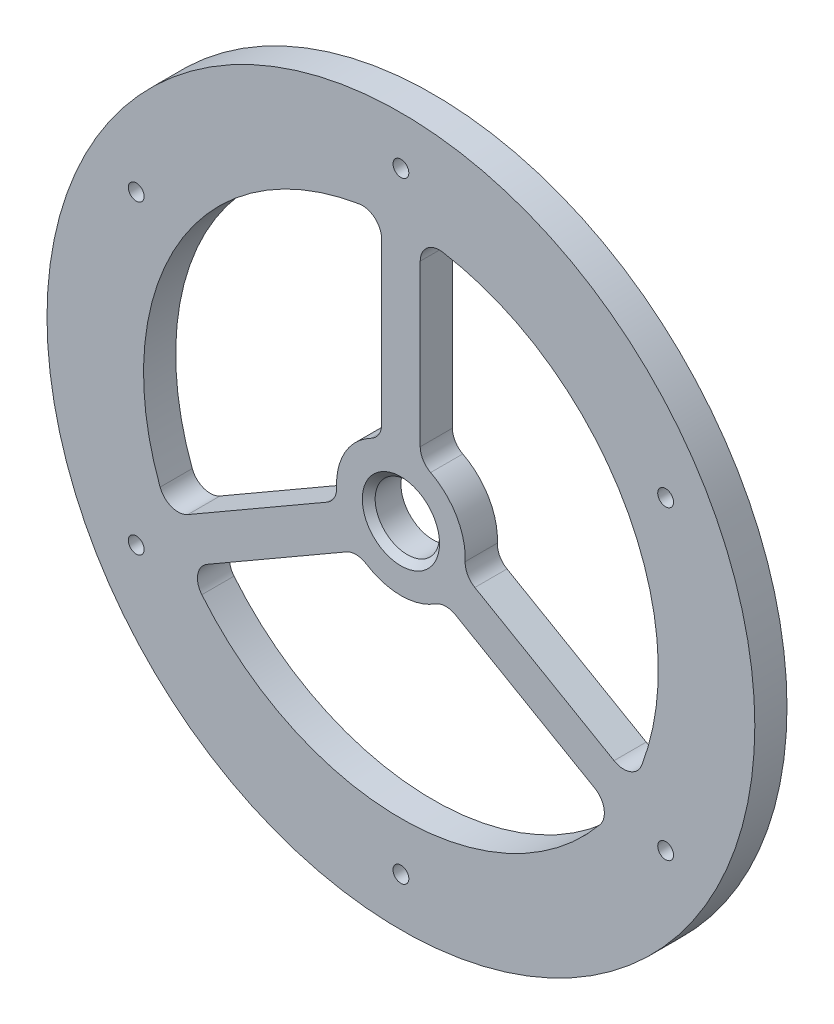
ISO-10303-21;
HEADER;
FILE_DESCRIPTION(('STEP AP214'),'2;1');
FILE_NAME('part.step','',(''),(''),'','','');
FILE_SCHEMA(('AUTOMOTIVE_DESIGN { 1 0 10303 214 1 1 1 1 }'));
ENDSEC;
DATA;
#1=APPLICATION_CONTEXT('core data for automotive mechanical design processes');
#2=APPLICATION_PROTOCOL_DEFINITION('international standard','automotive_design',2000,#1);
#3=PRODUCT_CONTEXT('',#1,'mechanical');
#4=PRODUCT('Part','Part','',(#3));
#5=PRODUCT_RELATED_PRODUCT_CATEGORY('part','',(#4));
#6=PRODUCT_DEFINITION_FORMATION('','',#4);
#7=PRODUCT_DEFINITION_CONTEXT('part definition',#1,'design');
#8=PRODUCT_DEFINITION('design','',#6,#7);
#9=PRODUCT_DEFINITION_SHAPE('','',#8);
#10=(LENGTH_UNIT() NAMED_UNIT(*) SI_UNIT(.MILLI.,.METRE.));
#11=(NAMED_UNIT(*) PLANE_ANGLE_UNIT() SI_UNIT($,.RADIAN.));
#12=(NAMED_UNIT(*) SI_UNIT($,.STERADIAN.) SOLID_ANGLE_UNIT());
#13=UNCERTAINTY_MEASURE_WITH_UNIT(LENGTH_MEASURE(1.E-05),#10,'distance_accuracy_value','');
#14=(GEOMETRIC_REPRESENTATION_CONTEXT(3) GLOBAL_UNCERTAINTY_ASSIGNED_CONTEXT((#13)) GLOBAL_UNIT_ASSIGNED_CONTEXT((#10,
#11,#12)) REPRESENTATION_CONTEXT('',''));
#15=CARTESIAN_POINT('',(0.,0.,0.));
#16=DIRECTION('',(0.,0.,1.));
#17=DIRECTION('',(1.,0.,0.));
#18=AXIS2_PLACEMENT_3D('',#15,#16,#17);
#19=CARTESIAN_POINT('',(-3.,0.,5.));
#20=DIRECTION('',(-1.,0.,0.));
#21=DIRECTION('',(0.,0.,1.));
#22=AXIS2_PLACEMENT_3D('',#19,#20,#21);
#23=PLANE('',#22);
#24=DIRECTION('',(0.,1.,0.));
#25=VECTOR('',#24,1.);
#26=CARTESIAN_POINT('',(-3.,0.,0.));
#27=LINE('',#26,#25);
#28=CARTESIAN_POINT('',(-3.,11.5325625946708,0.));
#29=VERTEX_POINT('',#28);
#30=CARTESIAN_POINT('',(-3.,36.5102725270574,0.));
#31=VERTEX_POINT('',#30);
#32=EDGE_CURVE('E227',#29,#31,#27,.T.);
#33=ORIENTED_EDGE('',*,*,#32,.F.);
#34=DIRECTION('',(0.,0.,-1.));
#35=VECTOR('',#34,1.);
#36=CARTESIAN_POINT('',(-3.,11.5325625946708,5.));
#37=LINE('',#36,#35);
#38=CARTESIAN_POINT('',(-3.,11.5325625946708,5.));
#39=VERTEX_POINT('',#38);
#40=EDGE_CURVE('E204',#29,#39,#37,.F.);
#41=ORIENTED_EDGE('',*,*,#40,.T.);
#42=DIRECTION('',(0.,1.,0.));
#43=VECTOR('',#42,1.);
#44=CARTESIAN_POINT('',(-3.,0.,5.));
#45=LINE('',#44,#43);
#46=CARTESIAN_POINT('',(-3.,36.5102725270574,5.));
#47=VERTEX_POINT('',#46);
#48=EDGE_CURVE('E500',#39,#47,#45,.T.);
#49=ORIENTED_EDGE('',*,*,#48,.T.);
#50=DIRECTION('',(0.,0.,1.));
#51=VECTOR('',#50,1.);
#52=CARTESIAN_POINT('',(-3.,36.5102725270574,0.));
#53=LINE('',#52,#51);
#54=EDGE_CURVE('E220',#47,#31,#53,.F.);
#55=ORIENTED_EDGE('',*,*,#54,.T.);
#56=EDGE_LOOP('',(#33,#41,#49,#55));
#57=FACE_BOUND('',#56,.T.);
#58=ADVANCED_FACE('F36',(#57),#23,.T.);
#59=CARTESIAN_POINT('',(0.,0.,5.));
#60=DIRECTION('',(0.,0.,-1.));
#61=DIRECTION('',(-1.,0.,0.));
#62=AXIS2_PLACEMENT_3D('',#59,#60,#61);
#63=CYLINDRICAL_SURFACE('',#62,10.);
#64=CARTESIAN_POINT('',(0.,0.,5.));
#65=DIRECTION('',(0.,0.,1.));
#66=DIRECTION('',(1.,0.,0.));
#67=AXIS2_PLACEMENT_3D('',#64,#65,#66);
#68=CIRCLE('',#67,10.);
#69=CARTESIAN_POINT('',(-4.61538461538461,8.87120199590061,5.));
#70=VERTEX_POINT('',#69);
#71=CARTESIAN_POINT('',(-9.99037859824546,-0.438560672791265,5.));
#72=VERTEX_POINT('',#71);
#73=EDGE_CURVE('E219',#70,#72,#68,.T.);
#74=ORIENTED_EDGE('',*,*,#73,.F.);
#75=DIRECTION('',(0.,0.,-1.));
#76=VECTOR('',#75,1.);
#77=CARTESIAN_POINT('',(-4.61538461538461,8.87120199590061,5.));
#78=LINE('',#77,#76);
#79=CARTESIAN_POINT('',(-4.61538461538461,8.87120199590061,0.));
#80=VERTEX_POINT('',#79);
#81=EDGE_CURVE('E203',#70,#80,#78,.T.);
#82=ORIENTED_EDGE('',*,*,#81,.T.);
#83=CARTESIAN_POINT('',(0.,0.,0.));
#84=DIRECTION('',(0.,0.,1.));
#85=DIRECTION('',(1.,0.,0.));
#86=AXIS2_PLACEMENT_3D('',#83,#84,#85);
#87=CIRCLE('',#86,10.);
#88=CARTESIAN_POINT('',(-9.99037859824546,-0.438560672791265,0.));
#89=VERTEX_POINT('',#88);
#90=EDGE_CURVE('E216',#80,#89,#87,.T.);
#91=ORIENTED_EDGE('',*,*,#90,.T.);
#92=DIRECTION('',(0.,0.,-1.));
#93=VECTOR('',#92,1.);
#94=CARTESIAN_POINT('',(-9.99037859824546,-0.438560672791265,5.));
#95=LINE('',#94,#93);
#96=EDGE_CURVE('E221',#89,#72,#95,.F.);
#97=ORIENTED_EDGE('',*,*,#96,.T.);
#98=EDGE_LOOP('',(#74,#82,#91,#97));
#99=FACE_BOUND('',#98,.T.);
#100=ADVANCED_FACE('F215',(#99),#63,.T.);
#101=CARTESIAN_POINT('',(-1.49999999999998,2.59807621135333,5.));
#102=DIRECTION('',(0.499999999999992,-0.866025403784443,0.));
#103=DIRECTION('',(0.866025403784443,0.499999999999992,0.));
#104=AXIS2_PLACEMENT_3D('',#101,#102,#103);
#105=PLANE('',#104);
#106=DIRECTION('',(-0.866025403784443,-0.499999999999992,0.));
#107=VECTOR('',#106,1.);
#108=CARTESIAN_POINT('',(-1.49999999999998,2.59807621135333,5.));
#109=LINE('',#108,#107);
#110=CARTESIAN_POINT('',(-11.4874921777191,-3.16820508598198,5.));
#111=VERTEX_POINT('',#110);
#112=CARTESIAN_POINT('',(-33.1188235075249,-15.6570600521751,5.));
#113=VERTEX_POINT('',#112);
#114=EDGE_CURVE('E504',#111,#113,#109,.T.);
#115=ORIENTED_EDGE('',*,*,#114,.F.);
#116=DIRECTION('',(0.,0.,1.));
#117=VECTOR('',#116,1.);
#118=CARTESIAN_POINT('',(-11.4874921777191,-3.16820508598197,0.));
#119=LINE('',#118,#117);
#120=CARTESIAN_POINT('',(-11.4874921777191,-3.16820508598198,0.));
#121=VERTEX_POINT('',#120);
#122=EDGE_CURVE('E246',#111,#121,#119,.F.);
#123=ORIENTED_EDGE('',*,*,#122,.T.);
#124=DIRECTION('',(-0.866025403784443,-0.499999999999992,0.));
#125=VECTOR('',#124,1.);
#126=CARTESIAN_POINT('',(-1.49999999999998,2.59807621135333,0.));
#127=LINE('',#126,#125);
#128=CARTESIAN_POINT('',(-33.1188235075249,-15.6570600521751,0.));
#129=VERTEX_POINT('',#128);
#130=EDGE_CURVE('E226',#121,#129,#127,.T.);
#131=ORIENTED_EDGE('',*,*,#130,.T.);
#132=DIRECTION('',(0.,0.,-1.));
#133=VECTOR('',#132,1.);
#134=CARTESIAN_POINT('',(-33.1188235075249,-15.6570600521751,5.));
#135=LINE('',#134,#133);
#136=EDGE_CURVE('E244',#129,#113,#135,.F.);
#137=ORIENTED_EDGE('',*,*,#136,.T.);
#138=EDGE_LOOP('',(#115,#123,#131,#137));
#139=FACE_BOUND('',#138,.T.);
#140=ADVANCED_FACE('F355',(#139),#105,.F.);
#141=CARTESIAN_POINT('',(0.,0.,5.));
#142=DIRECTION('',(0.,0.,-1.));
#143=DIRECTION('',(-1.,0.,0.));
#144=AXIS2_PLACEMENT_3D('',#141,#142,#143);
#145=CYLINDRICAL_SURFACE('',#144,40.);
#146=CARTESIAN_POINT('',(0.,0.,0.));
#147=DIRECTION('',(0.,0.,1.));
#148=DIRECTION('',(1.,0.,0.));
#149=AXIS2_PLACEMENT_3D('',#146,#147,#148);
#150=CIRCLE('',#149,40.);
#151=CARTESIAN_POINT('',(-30.9392686567838,-25.3527445256595,0.));
#152=VERTEX_POINT('',#151);
#153=CARTESIAN_POINT('',(30.9392686567834,-25.35274452566,0.));
#154=VERTEX_POINT('',#153);
#155=EDGE_CURVE('E538',#152,#154,#150,.T.);
#156=ORIENTED_EDGE('',*,*,#155,.F.);
#157=DIRECTION('',(0.,0.,-1.));
#158=VECTOR('',#157,1.);
#159=CARTESIAN_POINT('',(-30.9392686567838,-25.3527445256595,5.));
#160=LINE('',#159,#158);
#161=CARTESIAN_POINT('',(-30.9392686567838,-25.3527445256595,5.));
#162=VERTEX_POINT('',#161);
#163=EDGE_CURVE('E282',#152,#162,#160,.F.);
#164=ORIENTED_EDGE('',*,*,#163,.T.);
#165=CARTESIAN_POINT('',(0.,0.,5.));
#166=DIRECTION('',(0.,0.,1.));
#167=DIRECTION('',(1.,0.,0.));
#168=AXIS2_PLACEMENT_3D('',#165,#166,#167);
#169=CIRCLE('',#168,40.);
#170=CARTESIAN_POINT('',(30.9392686567834,-25.35274452566,5.));
#171=VERTEX_POINT('',#170);
#172=EDGE_CURVE('E485',#162,#171,#169,.T.);
#173=ORIENTED_EDGE('',*,*,#172,.T.);
#174=DIRECTION('',(0.,0.,-1.));
#175=VECTOR('',#174,1.);
#176=CARTESIAN_POINT('',(30.9392686567834,-25.35274452566,5.));
#177=LINE('',#176,#175);
#178=EDGE_CURVE('E279',#171,#154,#177,.T.);
#179=ORIENTED_EDGE('',*,*,#178,.T.);
#180=EDGE_LOOP('',(#156,#164,#173,#179));
#181=FACE_BOUND('',#180,.T.);
#182=ADVANCED_FACE('F379',(#181),#145,.F.);
#183=CARTESIAN_POINT('',(1.49999999999998,-2.59807621135333,5.));
#184=DIRECTION('',(0.499999999999992,-0.866025403784443,0.));
#185=DIRECTION('',(0.866025403784443,0.499999999999992,0.));
#186=AXIS2_PLACEMENT_3D('',#183,#184,#185);
#187=PLANE('',#186);
#188=DIRECTION('',(-0.866025403784443,-0.499999999999992,0.));
#189=VECTOR('',#188,1.);
#190=CARTESIAN_POINT('',(1.49999999999998,-2.59807621135333,0.));
#191=LINE('',#190,#189);
#192=CARTESIAN_POINT('',(-8.48749217771917,-8.36435750868863,0.));
#193=VERTEX_POINT('',#192);
#194=CARTESIAN_POINT('',(-30.1188235075249,-20.8532124748817,0.));
#195=VERTEX_POINT('',#194);
#196=EDGE_CURVE('E541',#193,#195,#191,.T.);
#197=ORIENTED_EDGE('',*,*,#196,.F.);
#198=DIRECTION('',(0.,0.,-1.));
#199=VECTOR('',#198,1.);
#200=CARTESIAN_POINT('',(-8.48749217771917,-8.36435750868863,5.));
#201=LINE('',#200,#199);
#202=CARTESIAN_POINT('',(-8.48749217771917,-8.36435750868863,5.));
#203=VERTEX_POINT('',#202);
#204=EDGE_CURVE('E277',#193,#203,#201,.F.);
#205=ORIENTED_EDGE('',*,*,#204,.T.);
#206=DIRECTION('',(-0.866025403784443,-0.499999999999992,0.));
#207=VECTOR('',#206,1.);
#208=CARTESIAN_POINT('',(1.49999999999998,-2.59807621135333,5.));
#209=LINE('',#208,#207);
#210=CARTESIAN_POINT('',(-30.1188235075249,-20.8532124748817,5.));
#211=VERTEX_POINT('',#210);
#212=EDGE_CURVE('E488',#203,#211,#209,.T.);
#213=ORIENTED_EDGE('',*,*,#212,.T.);
#214=DIRECTION('',(0.,0.,1.));
#215=VECTOR('',#214,1.);
#216=CARTESIAN_POINT('',(-30.118823507525,-20.8532124748817,0.));
#217=LINE('',#216,#215);
#218=EDGE_CURVE('E274',#211,#195,#217,.F.);
#219=ORIENTED_EDGE('',*,*,#218,.T.);
#220=EDGE_LOOP('',(#197,#205,#213,#219));
#221=FACE_BOUND('',#220,.T.);
#222=ADVANCED_FACE('F375',(#221),#187,.T.);
#223=CARTESIAN_POINT('',(0.,0.,5.));
#224=DIRECTION('',(0.,0.,-1.));
#225=DIRECTION('',(-1.,0.,0.));
#226=AXIS2_PLACEMENT_3D('',#223,#224,#225);
#227=CYLINDRICAL_SURFACE('',#226,10.);
#228=CARTESIAN_POINT('',(0.,0.,0.));
#229=DIRECTION('',(0.,0.,1.));
#230=DIRECTION('',(1.,0.,0.));
#231=AXIS2_PLACEMENT_3D('',#228,#229,#230);
#232=CIRCLE('',#231,10.);
#233=CARTESIAN_POINT('',(-5.37499398286092,-8.4326413231092,0.));
#234=VERTEX_POINT('',#233);
#235=CARTESIAN_POINT('',(5.3749939828608,-8.43264132310928,0.));
#236=VERTEX_POINT('',#235);
#237=EDGE_CURVE('E544',#234,#236,#232,.T.);
#238=ORIENTED_EDGE('',*,*,#237,.T.);
#239=DIRECTION('',(0.,0.,-1.));
#240=VECTOR('',#239,1.);
#241=CARTESIAN_POINT('',(5.37499398286079,-8.43264132310928,5.));
#242=LINE('',#241,#240);
#243=CARTESIAN_POINT('',(5.3749939828608,-8.43264132310928,5.));
#244=VERTEX_POINT('',#243);
#245=EDGE_CURVE('E272',#236,#244,#242,.F.);
#246=ORIENTED_EDGE('',*,*,#245,.T.);
#247=CARTESIAN_POINT('',(0.,0.,5.));
#248=DIRECTION('',(0.,0.,1.));
#249=DIRECTION('',(1.,0.,0.));
#250=AXIS2_PLACEMENT_3D('',#247,#248,#249);
#251=CIRCLE('',#250,10.);
#252=CARTESIAN_POINT('',(-5.37499398286092,-8.4326413231092,5.));
#253=VERTEX_POINT('',#252);
#254=EDGE_CURVE('E491',#253,#244,#251,.T.);
#255=ORIENTED_EDGE('',*,*,#254,.F.);
#256=DIRECTION('',(0.,0.,-1.));
#257=VECTOR('',#256,1.);
#258=CARTESIAN_POINT('',(-5.37499398286092,-8.4326413231092,5.));
#259=LINE('',#258,#257);
#260=EDGE_CURVE('E269',#253,#234,#259,.T.);
#261=ORIENTED_EDGE('',*,*,#260,.T.);
#262=EDGE_LOOP('',(#238,#246,#255,#261));
#263=FACE_BOUND('',#262,.T.);
#264=ADVANCED_FACE('F371',(#263),#227,.T.);
#265=CARTESIAN_POINT('',(0.,0.,5.));
#266=DIRECTION('',(0.,0.,-1.));
#267=DIRECTION('',(-1.,0.,0.));
#268=AXIS2_PLACEMENT_3D('',#265,#266,#267);
#269=CYLINDRICAL_SURFACE('',#268,40.);
#270=CARTESIAN_POINT('',(0.,0.,5.));
#271=DIRECTION('',(0.,0.,1.));
#272=DIRECTION('',(1.,0.,0.));
#273=AXIS2_PLACEMENT_3D('',#270,#271,#272);
#274=CIRCLE('',#273,40.);
#275=CARTESIAN_POINT('',(37.42575514327,-14.1178203684564,5.));
#276=VERTEX_POINT('',#275);
#277=CARTESIAN_POINT('',(6.48648648648649,39.4705648941161,5.));
#278=VERTEX_POINT('',#277);
#279=EDGE_CURVE('E471',#276,#278,#274,.T.);
#280=ORIENTED_EDGE('',*,*,#279,.T.);
#281=DIRECTION('',(0.,0.,-1.));
#282=VECTOR('',#281,1.);
#283=CARTESIAN_POINT('',(6.48648648648649,39.4705648941161,5.));
#284=LINE('',#283,#282);
#285=CARTESIAN_POINT('',(6.48648648648649,39.4705648941161,0.));
#286=VERTEX_POINT('',#285);
#287=EDGE_CURVE('E210',#278,#286,#284,.T.);
#288=ORIENTED_EDGE('',*,*,#287,.T.);
#289=CARTESIAN_POINT('',(0.,0.,0.));
#290=DIRECTION('',(0.,0.,1.));
#291=DIRECTION('',(1.,0.,0.));
#292=AXIS2_PLACEMENT_3D('',#289,#290,#291);
#293=CIRCLE('',#292,40.);
#294=CARTESIAN_POINT('',(37.42575514327,-14.1178203684564,0.));
#295=VERTEX_POINT('',#294);
#296=EDGE_CURVE('E527',#295,#286,#293,.T.);
#297=ORIENTED_EDGE('',*,*,#296,.F.);
#298=DIRECTION('',(0.,0.,-1.));
#299=VECTOR('',#298,1.);
#300=CARTESIAN_POINT('',(37.42575514327,-14.1178203684564,5.));
#301=LINE('',#300,#299);
#302=EDGE_CURVE('E58',#295,#276,#301,.F.);
#303=ORIENTED_EDGE('',*,*,#302,.T.);
#304=EDGE_LOOP('',(#280,#288,#297,#303));
#305=FACE_BOUND('',#304,.T.);
#306=ADVANCED_FACE('F374',(#305),#269,.F.);
#307=CARTESIAN_POINT('',(1.50000000000004,2.59807621135336,5.));
#308=DIRECTION('',(0.500000000000005,0.866025403784436,0.));
#309=DIRECTION('',(-0.866025403784436,0.500000000000005,0.));
#310=AXIS2_PLACEMENT_3D('',#307,#308,#309);
#311=PLANE('',#310);
#312=DIRECTION('',(0.866025403784436,-0.500000000000005,0.));
#313=VECTOR('',#312,1.);
#314=CARTESIAN_POINT('',(1.50000000000004,2.59807621135336,0.));
#315=LINE('',#314,#313);
#316=CARTESIAN_POINT('',(11.4874921777191,-3.16820508598209,0.));
#317=VERTEX_POINT('',#316);
#318=CARTESIAN_POINT('',(33.1188235075247,-15.6570600521755,0.));
#319=VERTEX_POINT('',#318);
#320=EDGE_CURVE('E530',#317,#319,#315,.T.);
#321=ORIENTED_EDGE('',*,*,#320,.F.);
#322=DIRECTION('',(0.,0.,-1.));
#323=VECTOR('',#322,1.);
#324=CARTESIAN_POINT('',(11.4874921777191,-3.16820508598209,5.));
#325=LINE('',#324,#323);
#326=CARTESIAN_POINT('',(11.4874921777191,-3.16820508598209,5.));
#327=VERTEX_POINT('',#326);
#328=EDGE_CURVE('E262',#317,#327,#325,.F.);
#329=ORIENTED_EDGE('',*,*,#328,.T.);
#330=DIRECTION('',(0.866025403784436,-0.500000000000005,0.));
#331=VECTOR('',#330,1.);
#332=CARTESIAN_POINT('',(1.50000000000004,2.59807621135336,5.));
#333=LINE('',#332,#331);
#334=CARTESIAN_POINT('',(33.1188235075247,-15.6570600521755,5.));
#335=VERTEX_POINT('',#334);
#336=EDGE_CURVE('E469',#327,#335,#333,.T.);
#337=ORIENTED_EDGE('',*,*,#336,.T.);
#338=DIRECTION('',(0.,0.,1.));
#339=VECTOR('',#338,1.);
#340=CARTESIAN_POINT('',(33.1188235075247,-15.6570600521755,0.));
#341=LINE('',#340,#339);
#342=EDGE_CURVE('E259',#335,#319,#341,.F.);
#343=ORIENTED_EDGE('',*,*,#342,.T.);
#344=EDGE_LOOP('',(#321,#329,#337,#343));
#345=FACE_BOUND('',#344,.T.);
#346=ADVANCED_FACE('F390',(#345),#311,.T.);
#347=CARTESIAN_POINT('',(0.,0.,5.));
#348=DIRECTION('',(0.,0.,-1.));
#349=DIRECTION('',(-1.,0.,0.));
#350=AXIS2_PLACEMENT_3D('',#347,#348,#349);
#351=CYLINDRICAL_SURFACE('',#350,10.);
#352=CARTESIAN_POINT('',(0.,0.,0.));
#353=DIRECTION('',(0.,0.,1.));
#354=DIRECTION('',(1.,0.,0.));
#355=AXIS2_PLACEMENT_3D('',#352,#353,#354);
#356=CIRCLE('',#355,10.);
#357=CARTESIAN_POINT('',(9.99037859824545,-0.438560672791368,0.));
#358=VERTEX_POINT('',#357);
#359=CARTESIAN_POINT('',(4.61538461538461,8.87120199590061,0.));
#360=VERTEX_POINT('',#359);
#361=EDGE_CURVE('E532',#358,#360,#356,.T.);
#362=ORIENTED_EDGE('',*,*,#361,.T.);
#363=DIRECTION('',(0.,0.,-1.));
#364=VECTOR('',#363,1.);
#365=CARTESIAN_POINT('',(4.61538461538461,8.87120199590061,5.));
#366=LINE('',#365,#364);
#367=CARTESIAN_POINT('',(4.61538461538461,8.87120199590061,5.));
#368=VERTEX_POINT('',#367);
#369=EDGE_CURVE('E257',#360,#368,#366,.F.);
#370=ORIENTED_EDGE('',*,*,#369,.T.);
#371=CARTESIAN_POINT('',(0.,0.,5.));
#372=DIRECTION('',(0.,0.,1.));
#373=DIRECTION('',(1.,0.,0.));
#374=AXIS2_PLACEMENT_3D('',#371,#372,#373);
#375=CIRCLE('',#374,10.);
#376=CARTESIAN_POINT('',(9.99037859824545,-0.438560672791368,5.));
#377=VERTEX_POINT('',#376);
#378=EDGE_CURVE('E475',#377,#368,#375,.T.);
#379=ORIENTED_EDGE('',*,*,#378,.F.);
#380=DIRECTION('',(0.,0.,-1.));
#381=VECTOR('',#380,1.);
#382=CARTESIAN_POINT('',(9.99037859824545,-0.438560672791368,5.));
#383=LINE('',#382,#381);
#384=EDGE_CURVE('E254',#377,#358,#383,.T.);
#385=ORIENTED_EDGE('',*,*,#384,.T.);
#386=EDGE_LOOP('',(#362,#370,#379,#385));
#387=FACE_BOUND('',#386,.T.);
#388=ADVANCED_FACE('F362',(#387),#351,.T.);
#389=CARTESIAN_POINT('',(0.,0.,5.));
#390=DIRECTION('',(0.,0.,-1.));
#391=DIRECTION('',(-1.,0.,0.));
#392=AXIS2_PLACEMENT_3D('',#389,#390,#391);
#393=CYLINDRICAL_SURFACE('',#392,55.);
#394=CARTESIAN_POINT('',(0.,0.,5.));
#395=DIRECTION('',(0.,0.,1.));
#396=DIRECTION('',(1.,0.,0.));
#397=AXIS2_PLACEMENT_3D('',#394,#395,#396);
#398=CIRCLE('',#397,55.);
#399=CARTESIAN_POINT('',(55.,0.,5.));
#400=VERTEX_POINT('',#399);
#401=EDGE_CURVE('E497',#400,#400,#398,.T.);
#402=ORIENTED_EDGE('',*,*,#401,.F.);
#403=EDGE_LOOP('',(#402));
#404=FACE_BOUND('',#403,.T.);
#405=CARTESIAN_POINT('',(0.,0.,0.));
#406=DIRECTION('',(0.,0.,1.));
#407=DIRECTION('',(1.,0.,0.));
#408=AXIS2_PLACEMENT_3D('',#405,#406,#407);
#409=CIRCLE('',#408,55.);
#410=CARTESIAN_POINT('',(55.,0.,0.));
#411=VERTEX_POINT('',#410);
#412=EDGE_CURVE('E232',#411,#411,#409,.T.);
#413=ORIENTED_EDGE('',*,*,#412,.T.);
#414=EDGE_LOOP('',(#413));
#415=FACE_BOUND('',#414,.T.);
#416=ADVANCED_FACE('F359',(#404,#415),#393,.T.);
#417=CARTESIAN_POINT('',(0.,0.,5.));
#418=DIRECTION('',(0.,0.,-1.));
#419=DIRECTION('',(-1.,0.,0.));
#420=AXIS2_PLACEMENT_3D('',#417,#418,#419);
#421=CYLINDRICAL_SURFACE('',#420,5.);
#422=CARTESIAN_POINT('',(0.,0.,3.99999999999996));
#423=DIRECTION('',(0.,0.,1.));
#424=DIRECTION('',(1.,0.,0.));
#425=AXIS2_PLACEMENT_3D('',#422,#423,#424);
#426=CIRCLE('',#425,5.);
#427=CARTESIAN_POINT('',(5.,0.,3.99999999999996));
#428=VERTEX_POINT('',#427);
#429=EDGE_CURVE('E44',#428,#428,#426,.T.);
#430=ORIENTED_EDGE('',*,*,#429,.T.);
#431=EDGE_LOOP('',(#430));
#432=FACE_BOUND('',#431,.T.);
#433=CARTESIAN_POINT('',(0.,0.,0.));
#434=DIRECTION('',(0.,0.,1.));
#435=DIRECTION('',(1.,0.,0.));
#436=AXIS2_PLACEMENT_3D('',#433,#434,#435);
#437=CIRCLE('',#436,5.);
#438=CARTESIAN_POINT('',(5.,0.,0.));
#439=VERTEX_POINT('',#438);
#440=EDGE_CURVE('E550',#439,#439,#437,.T.);
#441=ORIENTED_EDGE('',*,*,#440,.F.);
#442=EDGE_LOOP('',(#441));
#443=FACE_BOUND('',#442,.T.);
#444=ADVANCED_FACE('F337',(#432,#443),#421,.F.);
#445=CARTESIAN_POINT('',(-1.50000000000001,-2.59807621135331,5.));
#446=DIRECTION('',(0.500000000000004,0.866025403784436,0.));
#447=DIRECTION('',(-0.866025403784436,0.500000000000004,0.));
#448=AXIS2_PLACEMENT_3D('',#445,#446,#447);
#449=PLANE('',#448);
#450=DIRECTION('',(0.866025403784436,-0.500000000000004,0.));
#451=VECTOR('',#450,1.);
#452=CARTESIAN_POINT('',(-1.50000000000001,-2.59807621135331,5.));
#453=LINE('',#452,#451);
#454=CARTESIAN_POINT('',(8.48749217771904,-8.36435750868875,5.));
#455=VERTEX_POINT('',#454);
#456=CARTESIAN_POINT('',(30.1188235075247,-20.8532124748821,5.));
#457=VERTEX_POINT('',#456);
#458=EDGE_CURVE('E494',#455,#457,#453,.T.);
#459=ORIENTED_EDGE('',*,*,#458,.F.);
#460=DIRECTION('',(0.,0.,1.));
#461=VECTOR('',#460,1.);
#462=CARTESIAN_POINT('',(8.48749217771904,-8.36435750868875,0.));
#463=LINE('',#462,#461);
#464=CARTESIAN_POINT('',(8.48749217771904,-8.36435750868875,0.));
#465=VERTEX_POINT('',#464);
#466=EDGE_CURVE('E266',#455,#465,#463,.F.);
#467=ORIENTED_EDGE('',*,*,#466,.T.);
#468=DIRECTION('',(0.866025403784436,-0.500000000000004,0.));
#469=VECTOR('',#468,1.);
#470=CARTESIAN_POINT('',(-1.50000000000001,-2.59807621135331,0.));
#471=LINE('',#470,#469);
#472=CARTESIAN_POINT('',(30.1188235075247,-20.8532124748821,0.));
#473=VERTEX_POINT('',#472);
#474=EDGE_CURVE('E547',#465,#473,#471,.T.);
#475=ORIENTED_EDGE('',*,*,#474,.T.);
#476=DIRECTION('',(0.,0.,-1.));
#477=VECTOR('',#476,1.);
#478=CARTESIAN_POINT('',(30.1188235075247,-20.8532124748821,5.));
#479=LINE('',#478,#477);
#480=EDGE_CURVE('E264',#473,#457,#479,.F.);
#481=ORIENTED_EDGE('',*,*,#480,.T.);
#482=EDGE_LOOP('',(#459,#467,#475,#481));
#483=FACE_BOUND('',#482,.T.);
#484=ADVANCED_FACE('F366',(#483),#449,.F.);
#485=CARTESIAN_POINT('',(3.,0.,5.));
#486=DIRECTION('',(-1.,0.,0.));
#487=DIRECTION('',(0.,0.,1.));
#488=AXIS2_PLACEMENT_3D('',#485,#486,#487);
#489=PLANE('',#488);
#490=DIRECTION('',(0.,1.,0.));
#491=VECTOR('',#490,1.);
#492=CARTESIAN_POINT('',(3.,0.,5.));
#493=LINE('',#492,#491);
#494=CARTESIAN_POINT('',(3.,11.5325625946708,5.));
#495=VERTEX_POINT('',#494);
#496=CARTESIAN_POINT('',(3.,36.5102725270574,5.));
#497=VERTEX_POINT('',#496);
#498=EDGE_CURVE('E478',#495,#497,#493,.T.);
#499=ORIENTED_EDGE('',*,*,#498,.F.);
#500=DIRECTION('',(0.,0.,1.));
#501=VECTOR('',#500,1.);
#502=CARTESIAN_POINT('',(3.,11.5325625946708,0.));
#503=LINE('',#502,#501);
#504=CARTESIAN_POINT('',(3.,11.5325625946708,0.));
#505=VERTEX_POINT('',#504);
#506=EDGE_CURVE('E251',#495,#505,#503,.F.);
#507=ORIENTED_EDGE('',*,*,#506,.T.);
#508=DIRECTION('',(0.,1.,0.));
#509=VECTOR('',#508,1.);
#510=CARTESIAN_POINT('',(3.,0.,0.));
#511=LINE('',#510,#509);
#512=CARTESIAN_POINT('',(3.,36.5102725270574,0.));
#513=VERTEX_POINT('',#512);
#514=EDGE_CURVE('E535',#505,#513,#511,.T.);
#515=ORIENTED_EDGE('',*,*,#514,.T.);
#516=DIRECTION('',(0.,0.,-1.));
#517=VECTOR('',#516,1.);
#518=CARTESIAN_POINT('',(3.,36.5102725270574,5.));
#519=LINE('',#518,#517);
#520=EDGE_CURVE('E249',#513,#497,#519,.F.);
#521=ORIENTED_EDGE('',*,*,#520,.T.);
#522=EDGE_LOOP('',(#499,#507,#515,#521));
#523=FACE_BOUND('',#522,.T.);
#524=ADVANCED_FACE('F369',(#523),#489,.F.);
#525=CARTESIAN_POINT('',(0.,47.5,5.));
#526=DIRECTION('',(0.,0.,-1.));
#527=DIRECTION('',(-1.,0.,0.));
#528=AXIS2_PLACEMENT_3D('',#525,#526,#527);
#529=CYLINDRICAL_SURFACE('',#528,1.227);
#530=CARTESIAN_POINT('',(0.,47.5,5.));
#531=DIRECTION('',(0.,0.,1.));
#532=DIRECTION('',(1.,0.,0.));
#533=AXIS2_PLACEMENT_3D('',#530,#531,#532);
#534=CIRCLE('',#533,1.227);
#535=CARTESIAN_POINT('',(1.227,47.5,5.));
#536=VERTEX_POINT('',#535);
#537=EDGE_CURVE('E480',#536,#536,#534,.T.);
#538=ORIENTED_EDGE('',*,*,#537,.T.);
#539=EDGE_LOOP('',(#538));
#540=FACE_BOUND('',#539,.T.);
#541=CARTESIAN_POINT('',(0.,47.5,0.));
#542=DIRECTION('',(0.,0.,1.));
#543=DIRECTION('',(1.,0.,0.));
#544=AXIS2_PLACEMENT_3D('',#541,#542,#543);
#545=CIRCLE('',#544,1.227);
#546=CARTESIAN_POINT('',(1.227,47.5,0.));
#547=VERTEX_POINT('',#546);
#548=EDGE_CURVE('E524',#547,#547,#545,.T.);
#549=ORIENTED_EDGE('',*,*,#548,.F.);
#550=EDGE_LOOP('',(#549));
#551=FACE_BOUND('',#550,.T.);
#552=ADVANCED_FACE('F386',(#540,#551),#529,.F.);
#553=CARTESIAN_POINT('',(41.1362066797609,23.7499999999999,5.));
#554=DIRECTION('',(0.,0.,-1.));
#555=DIRECTION('',(-1.,0.,0.));
#556=AXIS2_PLACEMENT_3D('',#553,#554,#555);
#557=CYLINDRICAL_SURFACE('',#556,1.227);
#558=CARTESIAN_POINT('',(41.1362066797609,23.7499999999999,5.));
#559=DIRECTION('',(0.,0.,1.));
#560=DIRECTION('',(1.,0.,0.));
#561=AXIS2_PLACEMENT_3D('',#558,#559,#560);
#562=CIRCLE('',#561,1.227);
#563=CARTESIAN_POINT('',(42.3632066797609,23.7499999999999,5.));
#564=VERTEX_POINT('',#563);
#565=EDGE_CURVE('E889',#564,#564,#562,.T.);
#566=ORIENTED_EDGE('',*,*,#565,.T.);
#567=EDGE_LOOP('',(#566));
#568=FACE_BOUND('',#567,.T.);
#569=CARTESIAN_POINT('',(41.1362066797609,23.7499999999999,0.));
#570=DIRECTION('',(0.,0.,1.));
#571=DIRECTION('',(1.,0.,0.));
#572=AXIS2_PLACEMENT_3D('',#569,#570,#571);
#573=CIRCLE('',#572,1.227);
#574=CARTESIAN_POINT('',(42.3632066797609,23.7499999999999,0.));
#575=VERTEX_POINT('',#574);
#576=EDGE_CURVE('E521',#575,#575,#573,.T.);
#577=ORIENTED_EDGE('',*,*,#576,.F.);
#578=EDGE_LOOP('',(#577));
#579=FACE_BOUND('',#578,.T.);
#580=ADVANCED_FACE('F399',(#568,#579),#557,.F.);
#581=CARTESIAN_POINT('',(41.1362066797607,-23.7500000000002,5.));
#582=DIRECTION('',(0.,0.,-1.));
#583=DIRECTION('',(-1.,0.,0.));
#584=AXIS2_PLACEMENT_3D('',#581,#582,#583);
#585=CYLINDRICAL_SURFACE('',#584,1.227);
#586=CARTESIAN_POINT('',(41.1362066797607,-23.7500000000002,5.));
#587=DIRECTION('',(0.,0.,1.));
#588=DIRECTION('',(1.,0.,0.));
#589=AXIS2_PLACEMENT_3D('',#586,#587,#588);
#590=CIRCLE('',#589,1.227);
#591=CARTESIAN_POINT('',(42.3632066797607,-23.7500000000002,5.));
#592=VERTEX_POINT('',#591);
#593=EDGE_CURVE('E885',#592,#592,#590,.T.);
#594=ORIENTED_EDGE('',*,*,#593,.T.);
#595=EDGE_LOOP('',(#594));
#596=FACE_BOUND('',#595,.T.);
#597=CARTESIAN_POINT('',(41.1362066797607,-23.7500000000002,0.));
#598=DIRECTION('',(0.,0.,1.));
#599=DIRECTION('',(1.,0.,0.));
#600=AXIS2_PLACEMENT_3D('',#597,#598,#599);
#601=CIRCLE('',#600,1.227);
#602=CARTESIAN_POINT('',(42.3632066797607,-23.7500000000002,0.));
#603=VERTEX_POINT('',#602);
#604=EDGE_CURVE('E518',#603,#603,#601,.T.);
#605=ORIENTED_EDGE('',*,*,#604,.F.);
#606=EDGE_LOOP('',(#605));
#607=FACE_BOUND('',#606,.T.);
#608=ADVANCED_FACE('F403',(#596,#607),#585,.F.);
#609=CARTESIAN_POINT('',(-3.31690727190098E-13,-47.5,5.));
#610=DIRECTION('',(0.,0.,-1.));
#611=DIRECTION('',(-1.,0.,0.));
#612=AXIS2_PLACEMENT_3D('',#609,#610,#611);
#613=CYLINDRICAL_SURFACE('',#612,1.227);
#614=CARTESIAN_POINT('',(-3.31690727190098E-13,-47.5,5.));
#615=DIRECTION('',(0.,0.,1.));
#616=DIRECTION('',(1.,0.,0.));
#617=AXIS2_PLACEMENT_3D('',#614,#615,#616);
#618=CIRCLE('',#617,1.227);
#619=CARTESIAN_POINT('',(1.22699999999967,-47.5,5.));
#620=VERTEX_POINT('',#619);
#621=EDGE_CURVE('E881',#620,#620,#618,.T.);
#622=ORIENTED_EDGE('',*,*,#621,.T.);
#623=EDGE_LOOP('',(#622));
#624=FACE_BOUND('',#623,.T.);
#625=CARTESIAN_POINT('',(-3.31690727190098E-13,-47.5,0.));
#626=DIRECTION('',(0.,0.,1.));
#627=DIRECTION('',(1.,0.,0.));
#628=AXIS2_PLACEMENT_3D('',#625,#626,#627);
#629=CIRCLE('',#628,1.227);
#630=CARTESIAN_POINT('',(1.22699999999967,-47.5,0.));
#631=VERTEX_POINT('',#630);
#632=EDGE_CURVE('E515',#631,#631,#629,.T.);
#633=ORIENTED_EDGE('',*,*,#632,.F.);
#634=EDGE_LOOP('',(#633));
#635=FACE_BOUND('',#634,.T.);
#636=ADVANCED_FACE('F407',(#624,#635),#613,.F.);
#637=CARTESIAN_POINT('',(-41.1362066797608,-23.75,5.));
#638=DIRECTION('',(0.,0.,-1.));
#639=DIRECTION('',(-1.,0.,0.));
#640=AXIS2_PLACEMENT_3D('',#637,#638,#639);
#641=CYLINDRICAL_SURFACE('',#640,1.22700000000043);
#642=CARTESIAN_POINT('',(-41.1362066797608,-23.75,5.));
#643=DIRECTION('',(0.,0.,1.));
#644=DIRECTION('',(1.,0.,0.));
#645=AXIS2_PLACEMENT_3D('',#642,#643,#644);
#646=CIRCLE('',#645,1.22700000000043);
#647=CARTESIAN_POINT('',(-39.9092066797604,-23.75,5.));
#648=VERTEX_POINT('',#647);
#649=EDGE_CURVE('E877',#648,#648,#646,.T.);
#650=ORIENTED_EDGE('',*,*,#649,.T.);
#651=EDGE_LOOP('',(#650));
#652=FACE_BOUND('',#651,.T.);
#653=CARTESIAN_POINT('',(-41.1362066797608,-23.75,0.));
#654=DIRECTION('',(0.,0.,1.));
#655=DIRECTION('',(1.,0.,0.));
#656=AXIS2_PLACEMENT_3D('',#653,#654,#655);
#657=CIRCLE('',#656,1.22700000000043);
#658=CARTESIAN_POINT('',(-39.9092066797604,-23.75,0.));
#659=VERTEX_POINT('',#658);
#660=EDGE_CURVE('E512',#659,#659,#657,.T.);
#661=ORIENTED_EDGE('',*,*,#660,.F.);
#662=EDGE_LOOP('',(#661));
#663=FACE_BOUND('',#662,.T.);
#664=ADVANCED_FACE('F411',(#652,#663),#641,.F.);
#665=CARTESIAN_POINT('',(-41.1362066797606,23.7500000000005,5.));
#666=DIRECTION('',(0.,0.,-1.));
#667=DIRECTION('',(-1.,0.,0.));
#668=AXIS2_PLACEMENT_3D('',#665,#666,#667);
#669=CYLINDRICAL_SURFACE('',#668,1.227);
#670=CARTESIAN_POINT('',(-41.1362066797606,23.7500000000005,5.));
#671=DIRECTION('',(0.,0.,1.));
#672=DIRECTION('',(1.,0.,0.));
#673=AXIS2_PLACEMENT_3D('',#670,#671,#672);
#674=CIRCLE('',#673,1.227);
#675=CARTESIAN_POINT('',(-39.9092066797606,23.7500000000005,5.));
#676=VERTEX_POINT('',#675);
#677=EDGE_CURVE('E238',#676,#676,#674,.T.);
#678=ORIENTED_EDGE('',*,*,#677,.T.);
#679=EDGE_LOOP('',(#678));
#680=FACE_BOUND('',#679,.T.);
#681=CARTESIAN_POINT('',(-41.1362066797606,23.7500000000005,0.));
#682=DIRECTION('',(0.,0.,1.));
#683=DIRECTION('',(1.,0.,0.));
#684=AXIS2_PLACEMENT_3D('',#681,#682,#683);
#685=CIRCLE('',#684,1.227);
#686=CARTESIAN_POINT('',(-39.9092066797606,23.7500000000005,0.));
#687=VERTEX_POINT('',#686);
#688=EDGE_CURVE('E509',#687,#687,#685,.T.);
#689=ORIENTED_EDGE('',*,*,#688,.F.);
#690=EDGE_LOOP('',(#689));
#691=FACE_BOUND('',#690,.T.);
#692=ADVANCED_FACE('F415',(#680,#691),#669,.F.);
#693=CARTESIAN_POINT('',(0.,0.,5.));
#694=DIRECTION('',(0.,0.,-1.));
#695=DIRECTION('',(-1.,0.,0.));
#696=AXIS2_PLACEMENT_3D('',#693,#694,#695);
#697=CYLINDRICAL_SURFACE('',#696,40.);
#698=CARTESIAN_POINT('',(0.,0.,5.));
#699=DIRECTION('',(0.,0.,1.));
#700=DIRECTION('',(1.,0.,0.));
#701=AXIS2_PLACEMENT_3D('',#698,#699,#700);
#702=CIRCLE('',#701,40.);
#703=CARTESIAN_POINT('',(-6.48648648648649,39.4705648941161,5.));
#704=VERTEX_POINT('',#703);
#705=CARTESIAN_POINT('',(-37.4257551432701,-14.1178203684559,5.));
#706=VERTEX_POINT('',#705);
#707=EDGE_CURVE('E239',#704,#706,#702,.T.);
#708=ORIENTED_EDGE('',*,*,#707,.T.);
#709=DIRECTION('',(0.,0.,-1.));
#710=VECTOR('',#709,1.);
#711=CARTESIAN_POINT('',(-37.4257551432701,-14.1178203684559,5.));
#712=LINE('',#711,#710);
#713=CARTESIAN_POINT('',(-37.4257551432701,-14.1178203684559,0.));
#714=VERTEX_POINT('',#713);
#715=EDGE_CURVE('E286',#706,#714,#712,.T.);
#716=ORIENTED_EDGE('',*,*,#715,.T.);
#717=CARTESIAN_POINT('',(0.,0.,0.));
#718=DIRECTION('',(0.,0.,1.));
#719=DIRECTION('',(1.,0.,0.));
#720=AXIS2_PLACEMENT_3D('',#717,#718,#719);
#721=CIRCLE('',#720,40.);
#722=CARTESIAN_POINT('',(-6.48648648648649,39.4705648941161,0.));
#723=VERTEX_POINT('',#722);
#724=EDGE_CURVE('E230',#723,#714,#721,.T.);
#725=ORIENTED_EDGE('',*,*,#724,.F.);
#726=DIRECTION('',(0.,0.,-1.));
#727=VECTOR('',#726,1.);
#728=CARTESIAN_POINT('',(-6.48648648648649,39.4705648941161,5.));
#729=LINE('',#728,#727);
#730=EDGE_CURVE('E284',#723,#704,#729,.F.);
#731=ORIENTED_EDGE('',*,*,#730,.T.);
#732=EDGE_LOOP('',(#708,#716,#725,#731));
#733=FACE_BOUND('',#732,.T.);
#734=ADVANCED_FACE('F419',(#733),#697,.F.);
#735=CARTESIAN_POINT('',(0.,0.,5.));
#736=DIRECTION('',(0.,0.,1.));
#737=DIRECTION('',(1.,0.,0.));
#738=AXIS2_PLACEMENT_3D('',#735,#736,#737);
#739=PLANE('',#738);
#740=CARTESIAN_POINT('',(0.,0.,5.));
#741=DIRECTION('',(0.,0.,1.));
#742=DIRECTION('',(1.,0.,0.));
#743=AXIS2_PLACEMENT_3D('',#740,#741,#742);
#744=CIRCLE('',#743,6.00000000000005);
#745=CARTESIAN_POINT('',(6.00000000000005,0.,5.));
#746=VERTEX_POINT('',#745);
#747=EDGE_CURVE('E11',#746,#746,#744,.F.);
#748=ORIENTED_EDGE('',*,*,#747,.T.);
#749=EDGE_LOOP('',(#748));
#750=FACE_BOUND('',#749,.T.);
#751=ORIENTED_EDGE('',*,*,#677,.F.);
#752=EDGE_LOOP('',(#751));
#753=FACE_BOUND('',#752,.T.);
#754=ORIENTED_EDGE('',*,*,#649,.F.);
#755=EDGE_LOOP('',(#754));
#756=FACE_BOUND('',#755,.T.);
#757=ORIENTED_EDGE('',*,*,#621,.F.);
#758=EDGE_LOOP('',(#757));
#759=FACE_BOUND('',#758,.T.);
#760=ORIENTED_EDGE('',*,*,#593,.F.);
#761=EDGE_LOOP('',(#760));
#762=FACE_BOUND('',#761,.T.);
#763=ORIENTED_EDGE('',*,*,#565,.F.);
#764=EDGE_LOOP('',(#763));
#765=FACE_BOUND('',#764,.T.);
#766=ORIENTED_EDGE('',*,*,#537,.F.);
#767=EDGE_LOOP('',(#766));
#768=FACE_BOUND('',#767,.T.);
#769=ORIENTED_EDGE('',*,*,#279,.F.);
#770=CARTESIAN_POINT('',(34.6188235075247,-13.0589838408222,5.));
#771=DIRECTION('',(0.,0.,1.));
#772=DIRECTION('',(1.,0.,0.));
#773=AXIS2_PLACEMENT_3D('',#770,#771,#772);
#774=CIRCLE('',#773,3.);
#775=EDGE_CURVE('E329',#276,#335,#774,.F.);
#776=ORIENTED_EDGE('',*,*,#775,.T.);
#777=ORIENTED_EDGE('',*,*,#336,.F.);
#778=CARTESIAN_POINT('',(12.9874921777191,-0.570128874628779,5.));
#779=DIRECTION('',(0.,0.,1.));
#780=DIRECTION('',(1.,0.,0.));
#781=AXIS2_PLACEMENT_3D('',#778,#779,#780);
#782=CIRCLE('',#781,3.);
#783=EDGE_CURVE('E302',#327,#377,#782,.F.);
#784=ORIENTED_EDGE('',*,*,#783,.T.);
#785=ORIENTED_EDGE('',*,*,#378,.T.);
#786=CARTESIAN_POINT('',(6.,11.5325625946708,5.));
#787=DIRECTION('',(0.,0.,1.));
#788=DIRECTION('',(1.,0.,0.));
#789=AXIS2_PLACEMENT_3D('',#786,#787,#788);
#790=CIRCLE('',#789,3.);
#791=EDGE_CURVE('E298',#368,#495,#790,.F.);
#792=ORIENTED_EDGE('',*,*,#791,.T.);
#793=ORIENTED_EDGE('',*,*,#498,.T.);
#794=CARTESIAN_POINT('',(6.,36.5102725270574,5.));
#795=DIRECTION('',(0.,0.,1.));
#796=DIRECTION('',(1.,0.,0.));
#797=AXIS2_PLACEMENT_3D('',#794,#795,#796);
#798=CIRCLE('',#797,3.);
#799=EDGE_CURVE('E51',#497,#278,#798,.F.);
#800=ORIENTED_EDGE('',*,*,#799,.T.);
#801=EDGE_LOOP('',(#769,#776,#777,#784,#785,#792,#793,#800));
#802=FACE_BOUND('',#801,.T.);
#803=ORIENTED_EDGE('',*,*,#172,.F.);
#804=CARTESIAN_POINT('',(-28.618823507525,-23.451288686235,5.));
#805=DIRECTION('',(0.,0.,1.));
#806=DIRECTION('',(1.,0.,0.));
#807=AXIS2_PLACEMENT_3D('',#804,#805,#806);
#808=CIRCLE('',#807,3.);
#809=EDGE_CURVE('E314',#162,#211,#808,.F.);
#810=ORIENTED_EDGE('',*,*,#809,.T.);
#811=ORIENTED_EDGE('',*,*,#212,.F.);
#812=CARTESIAN_POINT('',(-6.98749217771919,-10.962433720042,5.));
#813=DIRECTION('',(0.,0.,1.));
#814=DIRECTION('',(1.,0.,0.));
#815=AXIS2_PLACEMENT_3D('',#812,#813,#814);
#816=CIRCLE('',#815,3.);
#817=EDGE_CURVE('E310',#203,#253,#816,.F.);
#818=ORIENTED_EDGE('',*,*,#817,.T.);
#819=ORIENTED_EDGE('',*,*,#254,.T.);
#820=CARTESIAN_POINT('',(6.98749217771903,-10.9624337200421,5.));
#821=DIRECTION('',(0.,0.,1.));
#822=DIRECTION('',(1.,0.,0.));
#823=AXIS2_PLACEMENT_3D('',#820,#821,#822);
#824=CIRCLE('',#823,3.);
#825=EDGE_CURVE('E306',#244,#455,#824,.F.);
#826=ORIENTED_EDGE('',*,*,#825,.T.);
#827=ORIENTED_EDGE('',*,*,#458,.T.);
#828=CARTESIAN_POINT('',(28.6188235075247,-23.4512886862355,5.));
#829=DIRECTION('',(0.,0.,1.));
#830=DIRECTION('',(1.,0.,0.));
#831=AXIS2_PLACEMENT_3D('',#828,#829,#830);
#832=CIRCLE('',#831,3.);
#833=EDGE_CURVE('E333',#457,#171,#832,.F.);
#834=ORIENTED_EDGE('',*,*,#833,.T.);
#835=EDGE_LOOP('',(#803,#810,#811,#818,#819,#826,#827,#834));
#836=FACE_BOUND('',#835,.T.);
#837=ORIENTED_EDGE('',*,*,#401,.T.);
#838=EDGE_LOOP('',(#837));
#839=FACE_BOUND('',#838,.T.);
#840=ORIENTED_EDGE('',*,*,#48,.F.);
#841=CARTESIAN_POINT('',(-6.,11.5325625946708,5.));
#842=DIRECTION('',(0.,0.,1.));
#843=DIRECTION('',(1.,0.,0.));
#844=AXIS2_PLACEMENT_3D('',#841,#842,#843);
#845=CIRCLE('',#844,3.);
#846=EDGE_CURVE('E209',#39,#70,#845,.F.);
#847=ORIENTED_EDGE('',*,*,#846,.T.);
#848=ORIENTED_EDGE('',*,*,#73,.T.);
#849=CARTESIAN_POINT('',(-12.9874921777191,-0.570128874628644,5.));
#850=DIRECTION('',(0.,0.,1.));
#851=DIRECTION('',(1.,0.,0.));
#852=AXIS2_PLACEMENT_3D('',#849,#850,#851);
#853=CIRCLE('',#852,3.);
#854=EDGE_CURVE('E294',#72,#111,#853,.F.);
#855=ORIENTED_EDGE('',*,*,#854,.T.);
#856=ORIENTED_EDGE('',*,*,#114,.T.);
#857=CARTESIAN_POINT('',(-34.6188235075249,-13.0589838408217,5.));
#858=DIRECTION('',(0.,0.,1.));
#859=DIRECTION('',(1.,0.,0.));
#860=AXIS2_PLACEMENT_3D('',#857,#858,#859);
#861=CIRCLE('',#860,3.);
#862=EDGE_CURVE('E318',#113,#706,#861,.F.);
#863=ORIENTED_EDGE('',*,*,#862,.T.);
#864=ORIENTED_EDGE('',*,*,#707,.F.);
#865=CARTESIAN_POINT('',(-6.,36.5102725270574,5.));
#866=DIRECTION('',(0.,0.,1.));
#867=DIRECTION('',(1.,0.,0.));
#868=AXIS2_PLACEMENT_3D('',#865,#866,#867);
#869=CIRCLE('',#868,3.);
#870=EDGE_CURVE('E322',#704,#47,#869,.F.);
#871=ORIENTED_EDGE('',*,*,#870,.T.);
#872=EDGE_LOOP('',(#840,#847,#848,#855,#856,#863,#864,#871));
#873=FACE_BOUND('',#872,.T.);
#874=ADVANCED_FACE('F467',(#750,#753,#756,#759,#762,#765,#768,#802,#836,#839,#873),#739,.T.);
#875=CARTESIAN_POINT('',(0.,0.,0.));
#876=DIRECTION('',(0.,0.,1.));
#877=DIRECTION('',(1.,0.,0.));
#878=AXIS2_PLACEMENT_3D('',#875,#876,#877);
#879=PLANE('',#878);
#880=ORIENTED_EDGE('',*,*,#688,.T.);
#881=EDGE_LOOP('',(#880));
#882=FACE_BOUND('',#881,.T.);
#883=ORIENTED_EDGE('',*,*,#660,.T.);
#884=EDGE_LOOP('',(#883));
#885=FACE_BOUND('',#884,.T.);
#886=ORIENTED_EDGE('',*,*,#632,.T.);
#887=EDGE_LOOP('',(#886));
#888=FACE_BOUND('',#887,.T.);
#889=ORIENTED_EDGE('',*,*,#604,.T.);
#890=EDGE_LOOP('',(#889));
#891=FACE_BOUND('',#890,.T.);
#892=ORIENTED_EDGE('',*,*,#576,.T.);
#893=EDGE_LOOP('',(#892));
#894=FACE_BOUND('',#893,.T.);
#895=ORIENTED_EDGE('',*,*,#548,.T.);
#896=EDGE_LOOP('',(#895));
#897=FACE_BOUND('',#896,.T.);
#898=ORIENTED_EDGE('',*,*,#320,.T.);
#899=CARTESIAN_POINT('',(34.6188235075247,-13.0589838408222,0.));
#900=DIRECTION('',(0.,0.,1.));
#901=DIRECTION('',(1.,0.,0.));
#902=AXIS2_PLACEMENT_3D('',#899,#900,#901);
#903=CIRCLE('',#902,3.);
#904=EDGE_CURVE('E327',#319,#295,#903,.T.);
#905=ORIENTED_EDGE('',*,*,#904,.T.);
#906=ORIENTED_EDGE('',*,*,#296,.T.);
#907=CARTESIAN_POINT('',(6.,36.5102725270574,0.));
#908=DIRECTION('',(0.,0.,1.));
#909=DIRECTION('',(1.,0.,0.));
#910=AXIS2_PLACEMENT_3D('',#907,#908,#909);
#911=CIRCLE('',#910,3.);
#912=EDGE_CURVE('E324',#286,#513,#911,.T.);
#913=ORIENTED_EDGE('',*,*,#912,.T.);
#914=ORIENTED_EDGE('',*,*,#514,.F.);
#915=CARTESIAN_POINT('',(6.,11.5325625946708,0.));
#916=DIRECTION('',(0.,0.,1.));
#917=DIRECTION('',(1.,0.,0.));
#918=AXIS2_PLACEMENT_3D('',#915,#916,#917);
#919=CIRCLE('',#918,3.);
#920=EDGE_CURVE('E296',#505,#360,#919,.T.);
#921=ORIENTED_EDGE('',*,*,#920,.T.);
#922=ORIENTED_EDGE('',*,*,#361,.F.);
#923=CARTESIAN_POINT('',(12.9874921777191,-0.570128874628779,0.));
#924=DIRECTION('',(0.,0.,1.));
#925=DIRECTION('',(1.,0.,0.));
#926=AXIS2_PLACEMENT_3D('',#923,#924,#925);
#927=CIRCLE('',#926,3.);
#928=EDGE_CURVE('E300',#358,#317,#927,.T.);
#929=ORIENTED_EDGE('',*,*,#928,.T.);
#930=EDGE_LOOP('',(#898,#905,#906,#913,#914,#921,#922,#929));
#931=FACE_BOUND('',#930,.T.);
#932=ORIENTED_EDGE('',*,*,#196,.T.);
#933=CARTESIAN_POINT('',(-28.618823507525,-23.451288686235,0.));
#934=DIRECTION('',(0.,0.,1.));
#935=DIRECTION('',(1.,0.,0.));
#936=AXIS2_PLACEMENT_3D('',#933,#934,#935);
#937=CIRCLE('',#936,3.);
#938=EDGE_CURVE('E312',#195,#152,#937,.T.);
#939=ORIENTED_EDGE('',*,*,#938,.T.);
#940=ORIENTED_EDGE('',*,*,#155,.T.);
#941=CARTESIAN_POINT('',(28.6188235075247,-23.4512886862355,0.));
#942=DIRECTION('',(0.,0.,1.));
#943=DIRECTION('',(1.,0.,0.));
#944=AXIS2_PLACEMENT_3D('',#941,#942,#943);
#945=CIRCLE('',#944,3.);
#946=EDGE_CURVE('E331',#154,#473,#945,.T.);
#947=ORIENTED_EDGE('',*,*,#946,.T.);
#948=ORIENTED_EDGE('',*,*,#474,.F.);
#949=CARTESIAN_POINT('',(6.98749217771903,-10.9624337200421,0.));
#950=DIRECTION('',(0.,0.,1.));
#951=DIRECTION('',(1.,0.,0.));
#952=AXIS2_PLACEMENT_3D('',#949,#950,#951);
#953=CIRCLE('',#952,3.);
#954=EDGE_CURVE('E304',#465,#236,#953,.T.);
#955=ORIENTED_EDGE('',*,*,#954,.T.);
#956=ORIENTED_EDGE('',*,*,#237,.F.);
#957=CARTESIAN_POINT('',(-6.98749217771919,-10.962433720042,0.));
#958=DIRECTION('',(0.,0.,1.));
#959=DIRECTION('',(1.,0.,0.));
#960=AXIS2_PLACEMENT_3D('',#957,#958,#959);
#961=CIRCLE('',#960,3.);
#962=EDGE_CURVE('E308',#234,#193,#961,.T.);
#963=ORIENTED_EDGE('',*,*,#962,.T.);
#964=EDGE_LOOP('',(#932,#939,#940,#947,#948,#955,#956,#963));
#965=FACE_BOUND('',#964,.T.);
#966=ORIENTED_EDGE('',*,*,#440,.T.);
#967=EDGE_LOOP('',(#966));
#968=FACE_BOUND('',#967,.T.);
#969=ORIENTED_EDGE('',*,*,#412,.F.);
#970=EDGE_LOOP('',(#969));
#971=FACE_BOUND('',#970,.T.);
#972=ORIENTED_EDGE('',*,*,#90,.F.);
#973=CARTESIAN_POINT('',(-6.,11.5325625946708,0.));
#974=DIRECTION('',(0.,0.,1.));
#975=DIRECTION('',(1.,0.,0.));
#976=AXIS2_PLACEMENT_3D('',#973,#974,#975);
#977=CIRCLE('',#976,3.);
#978=EDGE_CURVE('E199',#80,#29,#977,.T.);
#979=ORIENTED_EDGE('',*,*,#978,.T.);
#980=ORIENTED_EDGE('',*,*,#32,.T.);
#981=CARTESIAN_POINT('',(-6.,36.5102725270574,0.));
#982=DIRECTION('',(0.,0.,1.));
#983=DIRECTION('',(1.,0.,0.));
#984=AXIS2_PLACEMENT_3D('',#981,#982,#983);
#985=CIRCLE('',#984,3.);
#986=EDGE_CURVE('E320',#31,#723,#985,.T.);
#987=ORIENTED_EDGE('',*,*,#986,.T.);
#988=ORIENTED_EDGE('',*,*,#724,.T.);
#989=CARTESIAN_POINT('',(-34.6188235075249,-13.0589838408217,0.));
#990=DIRECTION('',(0.,0.,1.));
#991=DIRECTION('',(1.,0.,0.));
#992=AXIS2_PLACEMENT_3D('',#989,#990,#991);
#993=CIRCLE('',#992,3.);
#994=EDGE_CURVE('E316',#714,#129,#993,.T.);
#995=ORIENTED_EDGE('',*,*,#994,.T.);
#996=ORIENTED_EDGE('',*,*,#130,.F.);
#997=CARTESIAN_POINT('',(-12.9874921777191,-0.570128874628644,0.));
#998=DIRECTION('',(0.,0.,1.));
#999=DIRECTION('',(1.,0.,0.));
#1000=AXIS2_PLACEMENT_3D('',#997,#998,#999);
#1001=CIRCLE('',#1000,3.);
#1002=EDGE_CURVE('E225',#121,#89,#1001,.T.);
#1003=ORIENTED_EDGE('',*,*,#1002,.T.);
#1004=EDGE_LOOP('',(#972,#979,#980,#987,#988,#995,#996,#1003));
#1005=FACE_BOUND('',#1004,.T.);
#1006=ADVANCED_FACE('F223',(#882,#885,#888,#891,#894,#897,#931,#965,#968,#971,#1005),#879,.F.);
#1007=CARTESIAN_POINT('',(-6.,11.5325625946708,5.));
#1008=DIRECTION('',(0.,0.,-1.));
#1009=DIRECTION('',(-1.,0.,0.));
#1010=AXIS2_PLACEMENT_3D('',#1007,#1008,#1009);
#1011=CYLINDRICAL_SURFACE('',#1010,3.);
#1012=ORIENTED_EDGE('',*,*,#846,.F.);
#1013=ORIENTED_EDGE('',*,*,#40,.F.);
#1014=ORIENTED_EDGE('',*,*,#978,.F.);
#1015=ORIENTED_EDGE('',*,*,#81,.F.);
#1016=EDGE_LOOP('',(#1012,#1013,#1014,#1015));
#1017=FACE_BOUND('',#1016,.T.);
#1018=ADVANCED_FACE('F202',(#1017),#1011,.F.);
#1019=CARTESIAN_POINT('',(-12.9874921777191,-0.570128874628644,5.));
#1020=DIRECTION('',(0.,0.,-1.));
#1021=DIRECTION('',(-1.,0.,0.));
#1022=AXIS2_PLACEMENT_3D('',#1019,#1020,#1021);
#1023=CYLINDRICAL_SURFACE('',#1022,3.);
#1024=ORIENTED_EDGE('',*,*,#854,.F.);
#1025=ORIENTED_EDGE('',*,*,#96,.F.);
#1026=ORIENTED_EDGE('',*,*,#1002,.F.);
#1027=ORIENTED_EDGE('',*,*,#122,.F.);
#1028=EDGE_LOOP('',(#1024,#1025,#1026,#1027));
#1029=FACE_BOUND('',#1028,.T.);
#1030=ADVANCED_FACE('F423',(#1029),#1023,.F.);
#1031=CARTESIAN_POINT('',(6.,11.5325625946708,5.));
#1032=DIRECTION('',(0.,0.,-1.));
#1033=DIRECTION('',(-1.,0.,0.));
#1034=AXIS2_PLACEMENT_3D('',#1031,#1032,#1033);
#1035=CYLINDRICAL_SURFACE('',#1034,3.);
#1036=ORIENTED_EDGE('',*,*,#791,.F.);
#1037=ORIENTED_EDGE('',*,*,#369,.F.);
#1038=ORIENTED_EDGE('',*,*,#920,.F.);
#1039=ORIENTED_EDGE('',*,*,#506,.F.);
#1040=EDGE_LOOP('',(#1036,#1037,#1038,#1039));
#1041=FACE_BOUND('',#1040,.T.);
#1042=ADVANCED_FACE('F426',(#1041),#1035,.F.);
#1043=CARTESIAN_POINT('',(12.9874921777191,-0.570128874628779,5.));
#1044=DIRECTION('',(0.,0.,-1.));
#1045=DIRECTION('',(-1.,0.,0.));
#1046=AXIS2_PLACEMENT_3D('',#1043,#1044,#1045);
#1047=CYLINDRICAL_SURFACE('',#1046,3.);
#1048=ORIENTED_EDGE('',*,*,#783,.F.);
#1049=ORIENTED_EDGE('',*,*,#328,.F.);
#1050=ORIENTED_EDGE('',*,*,#928,.F.);
#1051=ORIENTED_EDGE('',*,*,#384,.F.);
#1052=EDGE_LOOP('',(#1048,#1049,#1050,#1051));
#1053=FACE_BOUND('',#1052,.T.);
#1054=ADVANCED_FACE('F430',(#1053),#1047,.F.);
#1055=CARTESIAN_POINT('',(6.98749217771903,-10.9624337200421,5.));
#1056=DIRECTION('',(0.,0.,-1.));
#1057=DIRECTION('',(-1.,0.,0.));
#1058=AXIS2_PLACEMENT_3D('',#1055,#1056,#1057);
#1059=CYLINDRICAL_SURFACE('',#1058,3.);
#1060=ORIENTED_EDGE('',*,*,#825,.F.);
#1061=ORIENTED_EDGE('',*,*,#245,.F.);
#1062=ORIENTED_EDGE('',*,*,#954,.F.);
#1063=ORIENTED_EDGE('',*,*,#466,.F.);
#1064=EDGE_LOOP('',(#1060,#1061,#1062,#1063));
#1065=FACE_BOUND('',#1064,.T.);
#1066=ADVANCED_FACE('F434',(#1065),#1059,.F.);
#1067=CARTESIAN_POINT('',(-6.98749217771919,-10.962433720042,5.));
#1068=DIRECTION('',(0.,0.,-1.));
#1069=DIRECTION('',(-1.,0.,0.));
#1070=AXIS2_PLACEMENT_3D('',#1067,#1068,#1069);
#1071=CYLINDRICAL_SURFACE('',#1070,3.);
#1072=ORIENTED_EDGE('',*,*,#817,.F.);
#1073=ORIENTED_EDGE('',*,*,#204,.F.);
#1074=ORIENTED_EDGE('',*,*,#962,.F.);
#1075=ORIENTED_EDGE('',*,*,#260,.F.);
#1076=EDGE_LOOP('',(#1072,#1073,#1074,#1075));
#1077=FACE_BOUND('',#1076,.T.);
#1078=ADVANCED_FACE('F438',(#1077),#1071,.F.);
#1079=CARTESIAN_POINT('',(-28.618823507525,-23.451288686235,5.));
#1080=DIRECTION('',(0.,0.,-1.));
#1081=DIRECTION('',(-1.,0.,0.));
#1082=AXIS2_PLACEMENT_3D('',#1079,#1080,#1081);
#1083=CYLINDRICAL_SURFACE('',#1082,3.);
#1084=ORIENTED_EDGE('',*,*,#809,.F.);
#1085=ORIENTED_EDGE('',*,*,#163,.F.);
#1086=ORIENTED_EDGE('',*,*,#938,.F.);
#1087=ORIENTED_EDGE('',*,*,#218,.F.);
#1088=EDGE_LOOP('',(#1084,#1085,#1086,#1087));
#1089=FACE_BOUND('',#1088,.T.);
#1090=ADVANCED_FACE('F442',(#1089),#1083,.F.);
#1091=CARTESIAN_POINT('',(-34.6188235075249,-13.0589838408217,5.));
#1092=DIRECTION('',(0.,0.,-1.));
#1093=DIRECTION('',(-1.,0.,0.));
#1094=AXIS2_PLACEMENT_3D('',#1091,#1092,#1093);
#1095=CYLINDRICAL_SURFACE('',#1094,3.);
#1096=ORIENTED_EDGE('',*,*,#862,.F.);
#1097=ORIENTED_EDGE('',*,*,#136,.F.);
#1098=ORIENTED_EDGE('',*,*,#994,.F.);
#1099=ORIENTED_EDGE('',*,*,#715,.F.);
#1100=EDGE_LOOP('',(#1096,#1097,#1098,#1099));
#1101=FACE_BOUND('',#1100,.T.);
#1102=ADVANCED_FACE('F446',(#1101),#1095,.F.);
#1103=CARTESIAN_POINT('',(-6.,36.5102725270574,5.));
#1104=DIRECTION('',(0.,0.,-1.));
#1105=DIRECTION('',(-1.,0.,0.));
#1106=AXIS2_PLACEMENT_3D('',#1103,#1104,#1105);
#1107=CYLINDRICAL_SURFACE('',#1106,3.);
#1108=ORIENTED_EDGE('',*,*,#870,.F.);
#1109=ORIENTED_EDGE('',*,*,#730,.F.);
#1110=ORIENTED_EDGE('',*,*,#986,.F.);
#1111=ORIENTED_EDGE('',*,*,#54,.F.);
#1112=EDGE_LOOP('',(#1108,#1109,#1110,#1111));
#1113=FACE_BOUND('',#1112,.T.);
#1114=ADVANCED_FACE('F450',(#1113),#1107,.F.);
#1115=CARTESIAN_POINT('',(6.,36.5102725270574,5.));
#1116=DIRECTION('',(0.,0.,-1.));
#1117=DIRECTION('',(-1.,0.,0.));
#1118=AXIS2_PLACEMENT_3D('',#1115,#1116,#1117);
#1119=CYLINDRICAL_SURFACE('',#1118,3.);
#1120=ORIENTED_EDGE('',*,*,#799,.F.);
#1121=ORIENTED_EDGE('',*,*,#520,.F.);
#1122=ORIENTED_EDGE('',*,*,#912,.F.);
#1123=ORIENTED_EDGE('',*,*,#287,.F.);
#1124=EDGE_LOOP('',(#1120,#1121,#1122,#1123));
#1125=FACE_BOUND('',#1124,.T.);
#1126=ADVANCED_FACE('F454',(#1125),#1119,.F.);
#1127=CARTESIAN_POINT('',(34.6188235075247,-13.0589838408222,5.));
#1128=DIRECTION('',(0.,0.,-1.));
#1129=DIRECTION('',(-1.,0.,0.));
#1130=AXIS2_PLACEMENT_3D('',#1127,#1128,#1129);
#1131=CYLINDRICAL_SURFACE('',#1130,3.);
#1132=ORIENTED_EDGE('',*,*,#775,.F.);
#1133=ORIENTED_EDGE('',*,*,#302,.F.);
#1134=ORIENTED_EDGE('',*,*,#904,.F.);
#1135=ORIENTED_EDGE('',*,*,#342,.F.);
#1136=EDGE_LOOP('',(#1132,#1133,#1134,#1135));
#1137=FACE_BOUND('',#1136,.T.);
#1138=ADVANCED_FACE('F346',(#1137),#1131,.F.);
#1139=CARTESIAN_POINT('',(28.6188235075247,-23.4512886862355,5.));
#1140=DIRECTION('',(0.,0.,-1.));
#1141=DIRECTION('',(-1.,0.,0.));
#1142=AXIS2_PLACEMENT_3D('',#1139,#1140,#1141);
#1143=CYLINDRICAL_SURFACE('',#1142,3.);
#1144=ORIENTED_EDGE('',*,*,#833,.F.);
#1145=ORIENTED_EDGE('',*,*,#480,.F.);
#1146=ORIENTED_EDGE('',*,*,#946,.F.);
#1147=ORIENTED_EDGE('',*,*,#178,.F.);
#1148=EDGE_LOOP('',(#1144,#1145,#1146,#1147));
#1149=FACE_BOUND('',#1148,.T.);
#1150=ADVANCED_FACE('F341',(#1149),#1143,.F.);
#1151=CARTESIAN_POINT('',(0.,0.,3.99999999999996));
#1152=DIRECTION('',(0.,0.,1.));
#1153=DIRECTION('',(1.,0.,0.));
#1154=AXIS2_PLACEMENT_3D('',#1151,#1152,#1153);
#1155=CONICAL_SURFACE('',#1154,5.,0.785398163397453);
#1156=ORIENTED_EDGE('',*,*,#747,.F.);
#1157=EDGE_LOOP('',(#1156));
#1158=FACE_BOUND('',#1157,.T.);
#1159=ORIENTED_EDGE('',*,*,#429,.F.);
#1160=EDGE_LOOP('',(#1159));
#1161=FACE_BOUND('',#1160,.T.);
#1162=ADVANCED_FACE('F38',(#1158,#1161),#1155,.F.);
#1163=CLOSED_SHELL('',(#58,#100,#140,#182,#222,#264,#306,#346,#388,#416,#444,#484,#524,#552,
#580,#608,#636,#664,#692,#734,#874,#1006,#1018,#1030,#1042,#1054,#1066,#1078,#1090,#1102,#1114,
#1126,#1138,#1150,#1162));
#1164=MANIFOLD_SOLID_BREP('B2',#1163);
#1165=ADVANCED_BREP_SHAPE_REPRESENTATION('',(#18,#1164),#14);
#1166=SHAPE_DEFINITION_REPRESENTATION(#9,#1165);
ENDSEC;
END-ISO-10303-21;
